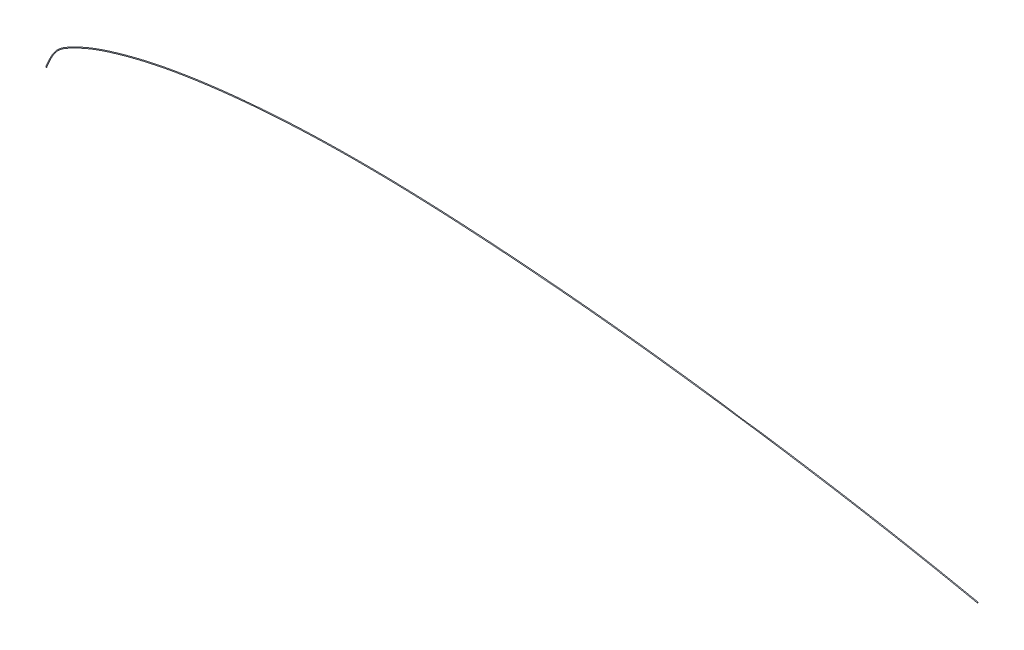
ISO-10303-21;
HEADER;
FILE_DESCRIPTION(('STEP AP214'),'2;1');
FILE_NAME('part.step','',(''),(''),'','','');
FILE_SCHEMA(('AUTOMOTIVE_DESIGN { 1 0 10303 214 1 1 1 1 }'));
ENDSEC;
DATA;
#1=APPLICATION_CONTEXT('core data for automotive mechanical design processes');
#2=APPLICATION_PROTOCOL_DEFINITION('international standard','automotive_design',2000,#1);
#3=PRODUCT_CONTEXT('',#1,'mechanical');
#4=PRODUCT('Part','Part','',(#3));
#5=PRODUCT_RELATED_PRODUCT_CATEGORY('part','',(#4));
#6=PRODUCT_DEFINITION_FORMATION('','',#4);
#7=PRODUCT_DEFINITION_CONTEXT('part definition',#1,'design');
#8=PRODUCT_DEFINITION('design','',#6,#7);
#9=PRODUCT_DEFINITION_SHAPE('','',#8);
#10=(LENGTH_UNIT() NAMED_UNIT(*) SI_UNIT(.MILLI.,.METRE.));
#11=(NAMED_UNIT(*) PLANE_ANGLE_UNIT() SI_UNIT($,.RADIAN.));
#12=(NAMED_UNIT(*) SI_UNIT($,.STERADIAN.) SOLID_ANGLE_UNIT());
#13=UNCERTAINTY_MEASURE_WITH_UNIT(LENGTH_MEASURE(1.E-05),#10,'distance_accuracy_value','');
#14=(GEOMETRIC_REPRESENTATION_CONTEXT(3) GLOBAL_UNCERTAINTY_ASSIGNED_CONTEXT((#13)) GLOBAL_UNIT_ASSIGNED_CONTEXT((#10,
#11,#12)) REPRESENTATION_CONTEXT('',''));
#15=CARTESIAN_POINT('',(0.,0.,0.));
#16=DIRECTION('',(0.,0.,1.));
#17=DIRECTION('',(1.,0.,0.));
#18=AXIS2_PLACEMENT_3D('',#15,#16,#17);
#19=CARTESIAN_POINT('',(1143.51,1.486563,0.));
#20=DIRECTION('',(0.981017726404871,0.193918076721637,0.));
#21=DIRECTION('',(0.,0.,1.));
#22=AXIS2_PLACEMENT_3D('',#19,#20,#21);
#23=PLANE('',#22);
#24=CARTESIAN_POINT('',(1143.51,1.486563,0.));
#25=DIRECTION('',(0.981017726404871,0.193918076721637,0.));
#26=DIRECTION('',(0.,0.,1.));
#27=AXIS2_PLACEMENT_3D('',#24,#25,#26);
#28=CIRCLE('',#27,0.5);
#29=CARTESIAN_POINT('',(1143.51,1.486563,0.5));
#30=VERTEX_POINT('',#29);
#31=EDGE_CURVE('E10',#30,#30,#28,.T.);
#32=ORIENTED_EDGE('',*,*,#31,.T.);
#33=EDGE_LOOP('',(#32));
#34=FACE_BOUND('',#33,.T.);
#35=ADVANCED_FACE('F37',(#34),#23,.T.);
#36=CARTESIAN_POINT('',(1143.51,1.486563,0.5));
#37=CARTESIAN_POINT('',(1124.46207060482,5.38974411269775,0.5));
#38=CARTESIAN_POINT('',(1105.4141412102,9.29292522407563,0.5));
#39=CARTESIAN_POINT('',(1029.38317967877,24.2088576357897,0.5));
#40=CARTESIAN_POINT('',(972.165379724474,34.0139840453461,0.5));
#41=CARTESIAN_POINT('',(876.754300763677,48.7648529899306,0.5));
#42=CARTESIAN_POINT('',(838.635614904716,54.2224738401747,0.5));
#43=CARTESIAN_POINT('',(762.400642536284,64.2291145867407,0.5));
#44=CARTESIAN_POINT('',(724.284739218981,68.7809880848684,0.5));
#45=CARTESIAN_POINT('',(648.043790834847,76.6614390836004,0.5));
#46=CARTESIAN_POINT('',(609.919128747438,79.9937079529373,0.5));
#47=CARTESIAN_POINT('',(533.678225680111,85.5801392898334,0.5));
#48=CARTESIAN_POINT('',(495.562165157022,87.8367519913323,0.5));
#49=CARTESIAN_POINT('',(419.304307356186,90.5487285366115,0.5));
#50=CARTESIAN_POINT('',(381.162639016645,91.0068472637165,0.5));
#51=CARTESIAN_POINT('',(304.863829096535,89.2084541382568,0.5));
#52=CARTESIAN_POINT('',(266.694921363674,86.9778200477368,0.5));
#53=CARTESIAN_POINT('',(209.48561215284,81.0164118034795,0.5));
#54=CARTESIAN_POINT('',(190.317278718343,78.5638013756268,0.5));
#55=CARTESIAN_POINT('',(152.136145317783,72.5133031307214,0.5));
#56=CARTESIAN_POINT('',(133.124023640907,68.9141766518025,0.5));
#57=CARTESIAN_POINT('',(104.679669718854,62.0435341883855,0.5));
#58=CARTESIAN_POINT('',(95.0717798047067,59.4592106570238,0.5));
#59=CARTESIAN_POINT('',(75.9498940817538,53.8284413194104,0.5));
#60=CARTESIAN_POINT('',(66.4377791275339,50.7795114415332,0.5));
#61=CARTESIAN_POINT('',(51.198012002929,44.9342966512661,0.5));
#62=CARTESIAN_POINT('',(45.3245774386292,42.4318795991824,0.5));
#63=CARTESIAN_POINT('',(36.6086483830433,38.3122228330052,0.5));
#64=CARTESIAN_POINT('',(33.7190424964081,36.8779987130043,0.5));
#65=CARTESIAN_POINT('',(27.9609287602858,33.8789725547974,0.5));
#66=CARTESIAN_POINT('',(25.0660187367064,32.3321325128898,0.5));
#67=CARTESIAN_POINT('',(19.5421071777571,28.9257430758887,0.5));
#68=CARTESIAN_POINT('',(16.9224303484844,27.0598498724912,0.5));
#69=CARTESIAN_POINT('',(12.3277842439242,22.7420671927505,0.5));
#70=CARTESIAN_POINT('',(10.3656214815009,20.2800240438444,0.5));
#71=CARTESIAN_POINT('',(5.15407876549317,12.2839240449656,0.5));
#72=CARTESIAN_POINT('',(2.57703938113762,6.14196202221847,0.5));
#73=CARTESIAN_POINT('',(0.,0.,0.5));
#74=CARTESIAN_POINT('',(1143.70391807672,0.50554527359513,0.5));
#75=CARTESIAN_POINT('',(1124.65598868155,4.40872638629077,0.5));
#76=CARTESIAN_POINT('',(1105.6108064302,8.31243855683846,0.5));
#77=CARTESIAN_POINT('',(1029.60168343433,23.2328785885634,0.5));
#78=CARTESIAN_POINT('',(972.395947717934,33.0408629657077,0.5));
#79=CARTESIAN_POINT('',(877.003005189012,47.7962448794968,0.5));
#80=CARTESIAN_POINT('',(838.891698231132,53.2557876942367,0.5));
#81=CARTESIAN_POINT('',(762.671741992761,63.2665318778937,0.5));
#82=CARTESIAN_POINT('',(724.564662838036,67.820907561146,0.5));
#83=CARTESIAN_POINT('',(648.343925696165,75.7074840380642,0.5));
#84=CARTESIAN_POINT('',(610.228737256552,79.0427977599006,0.5));
#85=CARTESIAN_POINT('',(534.005560572108,84.6351847450155,0.5));
#86=CARTESIAN_POINT('',(495.901344850365,86.8958990010136,0.5));
#87=CARTESIAN_POINT('',(419.672875701424,89.6189953315188,0.5));
#88=CARTESIAN_POINT('',(381.549505530026,90.0844063157171,0.5));
#89=CARTESIAN_POINT('',(305.294055543432,88.3054200530888,0.5));
#90=CARTESIAN_POINT('',(267.148220539226,86.085926596965,0.5));
#91=CARTESIAN_POINT('',(209.979703900395,80.1468616799469,0.5));
#92=CARTESIAN_POINT('',(190.826757783211,77.703086552974,0.5));
#93=CARTESIAN_POINT('',(152.679586568375,71.6736183505475,0.5));
#94=CARTESIAN_POINT('',(133.689775291689,68.0889277986573,0.5));
#95=CARTESIAN_POINT('',(105.286094382377,61.2482079139538,0.5));
#96=CARTESIAN_POINT('',(95.6910686792439,58.6738862975092,0.5));
#97=CARTESIAN_POINT('',(76.5938489272877,53.0632124538789,0.5));
#98=CARTESIAN_POINT('',(67.1020730483553,50.0310942553903,0.5));
#99=CARTESIAN_POINT('',(51.9070129440002,44.2286714893504,0.5));
#100=CARTESIAN_POINT('',(46.0512673837408,41.7444346065378,0.5));
#101=CARTESIAN_POINT('',(37.3610721261026,37.6534184352968,0.5));
#102=CARTESIAN_POINT('',(34.4799117555724,36.2289654333588,0.5));
#103=CARTESIAN_POINT('',(28.7382782054112,33.2497714201929,0.5));
#104=CARTESIAN_POINT('',(25.8538677874801,31.7147089317675,0.5));
#105=CARTESIAN_POINT('',(20.3809164664341,28.3795590570464,0.5));
#106=CARTESIAN_POINT('',(17.798474479872,26.5689525788122,0.5));
#107=CARTESIAN_POINT('',(13.2785838056553,22.4189361571236,0.5));
#108=CARTESIAN_POINT('',(11.3381782250594,20.0390876484918,0.5));
#109=CARTESIAN_POINT('',(6.16031267873579,12.2276997046709,0.5));
#110=CARTESIAN_POINT('',(3.57703938113762,6.1419620222157,0.5));
#111=CARTESIAN_POINT('',(1.,0.,0.5));
#112=CARTESIAN_POINT('',(1143.70391807672,0.50554527359513,-0.5));
#113=CARTESIAN_POINT('',(1124.65598868155,4.40872638629077,-0.5));
#114=CARTESIAN_POINT('',(1105.6108064302,8.31243855683846,-0.5));
#115=CARTESIAN_POINT('',(1029.60168343433,23.2328785885634,-0.5));
#116=CARTESIAN_POINT('',(972.395947717934,33.0408629657077,-0.5));
#117=CARTESIAN_POINT('',(877.003005189012,47.7962448794968,-0.5));
#118=CARTESIAN_POINT('',(838.891698231132,53.2557876942367,-0.5));
#119=CARTESIAN_POINT('',(762.671741992761,63.2665318778937,-0.5));
#120=CARTESIAN_POINT('',(724.564662838036,67.820907561146,-0.5));
#121=CARTESIAN_POINT('',(648.343925696165,75.7074840380642,-0.5));
#122=CARTESIAN_POINT('',(610.228737256552,79.0427977599006,-0.5));
#123=CARTESIAN_POINT('',(534.005560572108,84.6351847450155,-0.5));
#124=CARTESIAN_POINT('',(495.901344850365,86.8958990010136,-0.5));
#125=CARTESIAN_POINT('',(419.672875701424,89.6189953315188,-0.5));
#126=CARTESIAN_POINT('',(381.549505530026,90.0844063157171,-0.5));
#127=CARTESIAN_POINT('',(305.294055543432,88.3054200530888,-0.5));
#128=CARTESIAN_POINT('',(267.148220539226,86.085926596965,-0.5));
#129=CARTESIAN_POINT('',(209.979703900395,80.1468616799469,-0.5));
#130=CARTESIAN_POINT('',(190.826757783211,77.703086552974,-0.5));
#131=CARTESIAN_POINT('',(152.679586568375,71.6736183505475,-0.5));
#132=CARTESIAN_POINT('',(133.689775291689,68.0889277986573,-0.5));
#133=CARTESIAN_POINT('',(105.286094382377,61.2482079139538,-0.5));
#134=CARTESIAN_POINT('',(95.6910686792439,58.6738862975092,-0.5));
#135=CARTESIAN_POINT('',(76.5938489272877,53.0632124538789,-0.5));
#136=CARTESIAN_POINT('',(67.1020730483553,50.0310942553903,-0.5));
#137=CARTESIAN_POINT('',(51.9070129440002,44.2286714893504,-0.5));
#138=CARTESIAN_POINT('',(46.0512673837408,41.7444346065378,-0.5));
#139=CARTESIAN_POINT('',(37.3610721261026,37.6534184352968,-0.5));
#140=CARTESIAN_POINT('',(34.4799117555724,36.2289654333588,-0.5));
#141=CARTESIAN_POINT('',(28.7382782054112,33.2497714201929,-0.5));
#142=CARTESIAN_POINT('',(25.8538677874801,31.7147089317675,-0.5));
#143=CARTESIAN_POINT('',(20.3809164664341,28.3795590570464,-0.5));
#144=CARTESIAN_POINT('',(17.798474479872,26.5689525788122,-0.5));
#145=CARTESIAN_POINT('',(13.2785838056553,22.4189361571236,-0.5));
#146=CARTESIAN_POINT('',(11.3381782250594,20.0390876484918,-0.5));
#147=CARTESIAN_POINT('',(6.16031267873579,12.2276997046709,-0.5));
#148=CARTESIAN_POINT('',(3.57703938113762,6.1419620222157,-0.5));
#149=CARTESIAN_POINT('',(1.,0.,-0.5));
#150=CARTESIAN_POINT('',(1143.51,1.486563,-0.5));
#151=CARTESIAN_POINT('',(1124.46207060482,5.38974411269775,-0.5));
#152=CARTESIAN_POINT('',(1105.4141412102,9.29292522407563,-0.5));
#153=CARTESIAN_POINT('',(1029.38317967877,24.2088576357897,-0.5));
#154=CARTESIAN_POINT('',(972.165379724474,34.0139840453461,-0.5));
#155=CARTESIAN_POINT('',(876.754300763677,48.7648529899306,-0.5));
#156=CARTESIAN_POINT('',(838.635614904716,54.2224738401747,-0.5));
#157=CARTESIAN_POINT('',(762.400642536284,64.2291145867407,-0.5));
#158=CARTESIAN_POINT('',(724.284739218981,68.7809880848684,-0.5));
#159=CARTESIAN_POINT('',(648.043790834847,76.6614390836004,-0.5));
#160=CARTESIAN_POINT('',(609.919128747438,79.9937079529373,-0.5));
#161=CARTESIAN_POINT('',(533.678225680111,85.5801392898334,-0.5));
#162=CARTESIAN_POINT('',(495.562165157022,87.8367519913323,-0.5));
#163=CARTESIAN_POINT('',(419.304307356186,90.5487285366115,-0.5));
#164=CARTESIAN_POINT('',(381.162639016645,91.0068472637165,-0.5));
#165=CARTESIAN_POINT('',(304.863829096535,89.2084541382568,-0.5));
#166=CARTESIAN_POINT('',(266.694921363674,86.9778200477368,-0.5));
#167=CARTESIAN_POINT('',(209.48561215284,81.0164118034795,-0.5));
#168=CARTESIAN_POINT('',(190.317278718343,78.5638013756268,-0.5));
#169=CARTESIAN_POINT('',(152.136145317783,72.5133031307214,-0.5));
#170=CARTESIAN_POINT('',(133.124023640907,68.9141766518025,-0.5));
#171=CARTESIAN_POINT('',(104.679669718854,62.0435341883855,-0.5));
#172=CARTESIAN_POINT('',(95.0717798047067,59.4592106570238,-0.5));
#173=CARTESIAN_POINT('',(75.9498940817538,53.8284413194104,-0.5));
#174=CARTESIAN_POINT('',(66.4377791275339,50.7795114415332,-0.5));
#175=CARTESIAN_POINT('',(51.198012002929,44.9342966512661,-0.5));
#176=CARTESIAN_POINT('',(45.3245774386292,42.4318795991824,-0.5));
#177=CARTESIAN_POINT('',(36.6086483830433,38.3122228330052,-0.5));
#178=CARTESIAN_POINT('',(33.7190424964081,36.8779987130043,-0.5));
#179=CARTESIAN_POINT('',(27.9609287602858,33.8789725547974,-0.5));
#180=CARTESIAN_POINT('',(25.0660187367064,32.3321325128898,-0.5));
#181=CARTESIAN_POINT('',(19.5421071777571,28.9257430758887,-0.5));
#182=CARTESIAN_POINT('',(16.9224303484844,27.0598498724912,-0.5));
#183=CARTESIAN_POINT('',(12.3277842439242,22.7420671927505,-0.5));
#184=CARTESIAN_POINT('',(10.3656214815009,20.2800240438444,-0.5));
#185=CARTESIAN_POINT('',(5.15407876549317,12.2839240449656,-0.5));
#186=CARTESIAN_POINT('',(2.57703938113762,6.14196202221847,-0.5));
#187=CARTESIAN_POINT('',(0.,0.,-0.5));
#188=CARTESIAN_POINT('',(1143.31608192328,2.46758072640487,-0.5));
#189=CARTESIAN_POINT('',(1124.2681525281,6.37076183910473,-0.5));
#190=CARTESIAN_POINT('',(1105.21747599019,10.2734118913128,-0.5));
#191=CARTESIAN_POINT('',(1029.1646759232,25.1848366830161,-0.5));
#192=CARTESIAN_POINT('',(971.934811731013,34.9871051249845,-0.5));
#193=CARTESIAN_POINT('',(876.505596338342,49.7334611003644,-0.5));
#194=CARTESIAN_POINT('',(838.379531578301,55.1891599861127,-0.5));
#195=CARTESIAN_POINT('',(762.129543079807,65.1916972955877,-0.5));
#196=CARTESIAN_POINT('',(724.004815599926,69.7410686085908,-0.5));
#197=CARTESIAN_POINT('',(647.74365597353,77.6153941291365,-0.5));
#198=CARTESIAN_POINT('',(609.609520238324,80.944618145974,-0.5));
#199=CARTESIAN_POINT('',(533.350890788115,86.5250938346514,-0.5));
#200=CARTESIAN_POINT('',(495.222985463679,88.777604981651,-0.5));
#201=CARTESIAN_POINT('',(418.935739010949,91.4784617417042,-0.5));
#202=CARTESIAN_POINT('',(380.775772503264,91.929288211716,-0.5));
#203=CARTESIAN_POINT('',(304.433602649638,90.1114882234248,-0.5));
#204=CARTESIAN_POINT('',(266.241622188122,87.8697134985086,-0.5));
#205=CARTESIAN_POINT('',(208.991520405284,81.885961927012,-0.5));
#206=CARTESIAN_POINT('',(189.807799653475,79.4245161982797,-0.5));
#207=CARTESIAN_POINT('',(151.592704067192,73.3529879108952,-0.5));
#208=CARTESIAN_POINT('',(132.558271990125,69.7394255049477,-0.5));
#209=CARTESIAN_POINT('',(104.073245055332,62.8388604628172,-0.5));
#210=CARTESIAN_POINT('',(94.4524909301695,60.2445350165384,-0.5));
#211=CARTESIAN_POINT('',(75.3059392362198,54.5936701849418,-0.5));
#212=CARTESIAN_POINT('',(65.7734852067126,51.527928627676,-0.5));
#213=CARTESIAN_POINT('',(50.4890110618579,45.6399218131818,-0.5));
#214=CARTESIAN_POINT('',(44.5978874935177,43.1193245918269,-0.5));
#215=CARTESIAN_POINT('',(35.856224639984,38.9710272307136,-0.5));
#216=CARTESIAN_POINT('',(32.9581732372439,37.5270319926498,-0.5));
#217=CARTESIAN_POINT('',(27.1835793151603,34.508173689402,-0.5));
#218=CARTESIAN_POINT('',(24.2781696859326,32.9495560940121,-0.5));
#219=CARTESIAN_POINT('',(18.7032978890801,29.471927094731,-0.5));
#220=CARTESIAN_POINT('',(16.0463862170967,27.5507471661702,-0.5));
#221=CARTESIAN_POINT('',(11.3769846821931,23.0651982283773,-0.5));
#222=CARTESIAN_POINT('',(9.39306473794243,20.5209604391971,-0.5));
#223=CARTESIAN_POINT('',(4.14784485225054,12.3401483852604,-0.5));
#224=CARTESIAN_POINT('',(1.57703938113762,6.14196202222125,-0.5));
#225=CARTESIAN_POINT('',(-1.,0.,-0.5));
#226=CARTESIAN_POINT('',(1143.31608192328,2.46758072640487,0.5));
#227=CARTESIAN_POINT('',(1124.2681525281,6.37076183910473,0.5));
#228=CARTESIAN_POINT('',(1105.21747599019,10.2734118913128,0.5));
#229=CARTESIAN_POINT('',(1029.1646759232,25.1848366830161,0.5));
#230=CARTESIAN_POINT('',(971.934811731013,34.9871051249845,0.5));
#231=CARTESIAN_POINT('',(876.505596338342,49.7334611003644,0.5));
#232=CARTESIAN_POINT('',(838.379531578301,55.1891599861127,0.5));
#233=CARTESIAN_POINT('',(762.129543079807,65.1916972955877,0.5));
#234=CARTESIAN_POINT('',(724.004815599926,69.7410686085908,0.5));
#235=CARTESIAN_POINT('',(647.74365597353,77.6153941291365,0.5));
#236=CARTESIAN_POINT('',(609.609520238324,80.944618145974,0.5));
#237=CARTESIAN_POINT('',(533.350890788115,86.5250938346514,0.5));
#238=CARTESIAN_POINT('',(495.222985463679,88.777604981651,0.5));
#239=CARTESIAN_POINT('',(418.935739010949,91.4784617417042,0.5));
#240=CARTESIAN_POINT('',(380.775772503264,91.929288211716,0.5));
#241=CARTESIAN_POINT('',(304.433602649638,90.1114882234248,0.5));
#242=CARTESIAN_POINT('',(266.241622188122,87.8697134985086,0.5));
#243=CARTESIAN_POINT('',(208.991520405284,81.885961927012,0.5));
#244=CARTESIAN_POINT('',(189.807799653475,79.4245161982797,0.5));
#245=CARTESIAN_POINT('',(151.592704067192,73.3529879108952,0.5));
#246=CARTESIAN_POINT('',(132.558271990125,69.7394255049477,0.5));
#247=CARTESIAN_POINT('',(104.073245055332,62.8388604628172,0.5));
#248=CARTESIAN_POINT('',(94.4524909301695,60.2445350165384,0.5));
#249=CARTESIAN_POINT('',(75.3059392362198,54.5936701849418,0.5));
#250=CARTESIAN_POINT('',(65.7734852067126,51.527928627676,0.5));
#251=CARTESIAN_POINT('',(50.4890110618579,45.6399218131818,0.5));
#252=CARTESIAN_POINT('',(44.5978874935177,43.1193245918269,0.5));
#253=CARTESIAN_POINT('',(35.856224639984,38.9710272307136,0.5));
#254=CARTESIAN_POINT('',(32.9581732372439,37.5270319926498,0.5));
#255=CARTESIAN_POINT('',(27.1835793151603,34.508173689402,0.5));
#256=CARTESIAN_POINT('',(24.2781696859326,32.9495560940121,0.5));
#257=CARTESIAN_POINT('',(18.7032978890801,29.471927094731,0.5));
#258=CARTESIAN_POINT('',(16.0463862170967,27.5507471661702,0.5));
#259=CARTESIAN_POINT('',(11.3769846821931,23.0651982283773,0.5));
#260=CARTESIAN_POINT('',(9.39306473794243,20.5209604391971,0.5));
#261=CARTESIAN_POINT('',(4.14784485225054,12.3401483852604,0.5));
#262=CARTESIAN_POINT('',(1.57703938113762,6.14196202222125,0.5));
#263=CARTESIAN_POINT('',(-1.,0.,0.5));
#264=CARTESIAN_POINT('',(1143.51,1.486563,0.5));
#265=CARTESIAN_POINT('',(1124.46207060482,5.38974411269775,0.5));
#266=CARTESIAN_POINT('',(1105.4141412102,9.29292522407563,0.5));
#267=CARTESIAN_POINT('',(1029.38317967877,24.2088576357897,0.5));
#268=CARTESIAN_POINT('',(972.165379724474,34.0139840453461,0.5));
#269=CARTESIAN_POINT('',(876.754300763677,48.7648529899306,0.5));
#270=CARTESIAN_POINT('',(838.635614904716,54.2224738401747,0.5));
#271=CARTESIAN_POINT('',(762.400642536284,64.2291145867407,0.5));
#272=CARTESIAN_POINT('',(724.284739218981,68.7809880848684,0.5));
#273=CARTESIAN_POINT('',(648.043790834847,76.6614390836004,0.5));
#274=CARTESIAN_POINT('',(609.919128747438,79.9937079529373,0.5));
#275=CARTESIAN_POINT('',(533.678225680111,85.5801392898334,0.5));
#276=CARTESIAN_POINT('',(495.562165157022,87.8367519913323,0.5));
#277=CARTESIAN_POINT('',(419.304307356186,90.5487285366115,0.5));
#278=CARTESIAN_POINT('',(381.162639016645,91.0068472637165,0.5));
#279=CARTESIAN_POINT('',(304.863829096535,89.2084541382568,0.5));
#280=CARTESIAN_POINT('',(266.694921363674,86.9778200477368,0.5));
#281=CARTESIAN_POINT('',(209.48561215284,81.0164118034795,0.5));
#282=CARTESIAN_POINT('',(190.317278718343,78.5638013756268,0.5));
#283=CARTESIAN_POINT('',(152.136145317783,72.5133031307214,0.5));
#284=CARTESIAN_POINT('',(133.124023640907,68.9141766518025,0.5));
#285=CARTESIAN_POINT('',(104.679669718854,62.0435341883855,0.5));
#286=CARTESIAN_POINT('',(95.0717798047067,59.4592106570238,0.5));
#287=CARTESIAN_POINT('',(75.9498940817538,53.8284413194104,0.5));
#288=CARTESIAN_POINT('',(66.4377791275339,50.7795114415332,0.5));
#289=CARTESIAN_POINT('',(51.198012002929,44.9342966512661,0.5));
#290=CARTESIAN_POINT('',(45.3245774386292,42.4318795991824,0.5));
#291=CARTESIAN_POINT('',(36.6086483830433,38.3122228330052,0.5));
#292=CARTESIAN_POINT('',(33.7190424964081,36.8779987130043,0.5));
#293=CARTESIAN_POINT('',(27.9609287602858,33.8789725547974,0.5));
#294=CARTESIAN_POINT('',(25.0660187367064,32.3321325128898,0.5));
#295=CARTESIAN_POINT('',(19.5421071777571,28.9257430758887,0.5));
#296=CARTESIAN_POINT('',(16.9224303484844,27.0598498724912,0.5));
#297=CARTESIAN_POINT('',(12.3277842439242,22.7420671927505,0.5));
#298=CARTESIAN_POINT('',(10.3656214815009,20.2800240438444,0.5));
#299=CARTESIAN_POINT('',(5.15407876549317,12.2839240449656,0.5));
#300=CARTESIAN_POINT('',(2.57703938113762,6.14196202221847,0.5));
#301=CARTESIAN_POINT('',(0.,0.,0.5));
#302=(BOUNDED_SURFACE() B_SPLINE_SURFACE(3,3,((#36,#37,#38,#39,#40,#41,#42,#43,#44,#45,#46,#47,
#48,#49,#50,#51,#52,#53,#54,#55,#56,#57,#58,#59,#60,#61,#62,#63,#64,#65,#66,#67,#68,#69,#70,#71,
#72,#73),(#74,#75,#76,#77,#78,#79,#80,#81,#82,#83,#84,#85,#86,#87,#88,#89,#90,#91,#92,#93,#94,
#95,#96,#97,#98,#99,#100,#101,#102,#103,#104,#105,#106,#107,#108,#109,#110,#111),(#112,#113,
#114,#115,#116,#117,#118,#119,#120,#121,#122,#123,#124,#125,#126,#127,#128,#129,#130,#131,#132,
#133,#134,#135,#136,#137,#138,#139,#140,#141,#142,#143,#144,#145,#146,#147,#148,#149),(#150,
#151,#152,#153,#154,#155,#156,#157,#158,#159,#160,#161,#162,#163,#164,#165,#166,#167,#168,#169,
#170,#171,#172,#173,#174,#175,#176,#177,#178,#179,#180,#181,#182,#183,#184,#185,#186,#187),
(#188,#189,#190,#191,#192,#193,#194,#195,#196,#197,#198,#199,#200,#201,#202,#203,#204,#205,#206,
#207,#208,#209,#210,#211,#212,#213,#214,#215,#216,#217,#218,#219,#220,#221,#222,#223,#224,#225),
(#226,#227,#228,#229,#230,#231,#232,#233,#234,#235,#236,#237,#238,#239,#240,#241,#242,#243,#244,
#245,#246,#247,#248,#249,#250,#251,#252,#253,#254,#255,#256,#257,#258,#259,#260,#261,#262,#263),
(#264,#265,#266,#267,#268,#269,#270,#271,#272,#273,#274,#275,#276,#277,#278,#279,#280,#281,#282,
#283,#284,#285,#286,#287,#288,#289,#290,#291,#292,#293,#294,#295,#296,#297,#298,#299,#300,
#301)),.UNSPECIFIED.,.T.,.F.,.F.) B_SPLINE_SURFACE_WITH_KNOTS((4,3,4),(4,2,2,2,2,2,2,2,2,2,2,2,
2,2,2,2,2,2,4),(0.,0.5,1.),(0.,0.0496812988513004,0.197976307844625,0.296362491062684,
0.394433617199178,0.492205408317245,0.589753408165241,0.687151928165711,0.784753711389578,
0.834119584128113,0.883485456866648,0.908917356863356,0.934349256860064,0.950761942645048,
0.95896828553754,0.967174628430032,0.975380971322524,0.983587314215016,1.),
.UNSPECIFIED.) GEOMETRIC_REPRESENTATION_ITEM() RATIONAL_B_SPLINE_SURFACE(((1.,1.,1.,1.,1.,1.,1.,
1.,1.,1.,1.,1.,1.,1.,1.,1.,1.,1.,1.,1.,1.,1.,1.,1.,1.,1.,1.,1.,1.,1.,1.,1.,1.,1.,1.,1.,1.,1.),
(0.333333333333333,0.333333333333333,0.333333333333333,0.333333333333333,0.333333333333333,
0.333333333333333,0.333333333333333,0.333333333333333,0.333333333333333,0.333333333333333,
0.333333333333333,0.333333333333333,0.333333333333333,0.333333333333333,0.333333333333333,
0.333333333333333,0.333333333333333,0.333333333333333,0.333333333333333,0.333333333333333,
0.333333333333333,0.333333333333333,0.333333333333333,0.333333333333333,0.333333333333333,
0.333333333333333,0.333333333333333,0.333333333333333,0.333333333333333,0.333333333333333,
0.333333333333333,0.333333333333333,0.333333333333333,0.333333333333333,0.333333333333333,
0.333333333333333,0.333333333333333,0.333333333333333),(0.333333333333333,0.333333333333333,
0.333333333333333,0.333333333333333,0.333333333333333,0.333333333333333,0.333333333333333,
0.333333333333333,0.333333333333333,0.333333333333333,0.333333333333333,0.333333333333333,
0.333333333333333,0.333333333333333,0.333333333333333,0.333333333333333,0.333333333333333,
0.333333333333333,0.333333333333333,0.333333333333333,0.333333333333333,0.333333333333333,
0.333333333333333,0.333333333333333,0.333333333333333,0.333333333333333,0.333333333333333,
0.333333333333333,0.333333333333333,0.333333333333333,0.333333333333333,0.333333333333333,
0.333333333333333,0.333333333333333,0.333333333333333,0.333333333333333,0.333333333333333,
0.333333333333333),(1.,1.,1.,1.,1.,1.,1.,1.,1.,1.,1.,1.,1.,1.,1.,1.,1.,1.,1.,1.,1.,1.,1.,1.,1.,
1.,1.,1.,1.,1.,1.,1.,1.,1.,1.,1.,1.,1.),(0.333333333333333,0.333333333333333,0.333333333333333,
0.333333333333333,0.333333333333333,0.333333333333333,0.333333333333333,0.333333333333333,
0.333333333333333,0.333333333333333,0.333333333333333,0.333333333333333,0.333333333333333,
0.333333333333333,0.333333333333333,0.333333333333333,0.333333333333333,0.333333333333333,
0.333333333333333,0.333333333333333,0.333333333333333,0.333333333333333,0.333333333333333,
0.333333333333333,0.333333333333333,0.333333333333333,0.333333333333333,0.333333333333333,
0.333333333333333,0.333333333333333,0.333333333333333,0.333333333333333,0.333333333333333,
0.333333333333333,0.333333333333333,0.333333333333333,0.333333333333333,0.333333333333333),
(0.333333333333333,0.333333333333333,0.333333333333333,0.333333333333333,0.333333333333333,
0.333333333333333,0.333333333333333,0.333333333333333,0.333333333333333,0.333333333333333,
0.333333333333333,0.333333333333333,0.333333333333333,0.333333333333333,0.333333333333333,
0.333333333333333,0.333333333333333,0.333333333333333,0.333333333333333,0.333333333333333,
0.333333333333333,0.333333333333333,0.333333333333333,0.333333333333333,0.333333333333333,
0.333333333333333,0.333333333333333,0.333333333333333,0.333333333333333,0.333333333333333,
0.333333333333333,0.333333333333333,0.333333333333333,0.333333333333333,0.333333333333333,
0.333333333333333,0.333333333333333,0.333333333333333),(1.,1.,1.,1.,1.,1.,1.,1.,1.,1.,1.,1.,1.,
1.,1.,1.,1.,1.,1.,1.,1.,1.,1.,1.,1.,1.,1.,1.,1.,1.,1.,1.,1.,1.,1.,1.,1.,1.))) REPRESENTATION_ITEM('') SURFACE());
#303=CARTESIAN_POINT('',(0.,0.,0.));
#304=DIRECTION('',(0.,1.,0.));
#305=DIRECTION('',(0.,0.,1.));
#306=AXIS2_PLACEMENT_3D('',#303,#304,#305);
#307=CIRCLE('',#306,0.5);
#308=CARTESIAN_POINT('',(0.,0.,0.5));
#309=VERTEX_POINT('',#308);
#310=EDGE_CURVE('E47',#309,#309,#307,.T.);
#311=ORIENTED_EDGE('',*,*,#310,.T.);
#312=EDGE_LOOP('',(#311));
#313=FACE_BOUND('',#312,.T.);
#314=ORIENTED_EDGE('',*,*,#31,.F.);
#315=EDGE_LOOP('',(#314));
#316=FACE_BOUND('',#315,.T.);
#317=ADVANCED_FACE('F54',(#313,#316),#302,.F.);
#318=CARTESIAN_POINT('',(0.,-1.,0.));
#319=DIRECTION('',(0.,1.,0.));
#320=DIRECTION('',(0.,0.,1.));
#321=AXIS2_PLACEMENT_3D('',#318,#319,#320);
#322=CYLINDRICAL_SURFACE('',#321,0.5);
#323=CARTESIAN_POINT('',(0.,-1.,0.));
#324=DIRECTION('',(0.,1.,0.));
#325=DIRECTION('',(0.,0.,1.));
#326=AXIS2_PLACEMENT_3D('',#323,#324,#325);
#327=CIRCLE('',#326,0.5);
#328=CARTESIAN_POINT('',(0.,-1.,0.5));
#329=VERTEX_POINT('',#328);
#330=EDGE_CURVE('E43',#329,#329,#327,.T.);
#331=ORIENTED_EDGE('',*,*,#330,.T.);
#332=EDGE_LOOP('',(#331));
#333=FACE_BOUND('',#332,.T.);
#334=ORIENTED_EDGE('',*,*,#310,.F.);
#335=EDGE_LOOP('',(#334));
#336=FACE_BOUND('',#335,.T.);
#337=ADVANCED_FACE('F57',(#333,#336),#322,.T.);
#338=CARTESIAN_POINT('',(0.,-1.,0.));
#339=DIRECTION('',(0.,1.,0.));
#340=DIRECTION('',(0.,0.,1.));
#341=AXIS2_PLACEMENT_3D('',#338,#339,#340);
#342=PLANE('',#341);
#343=ORIENTED_EDGE('',*,*,#330,.F.);
#344=EDGE_LOOP('',(#343));
#345=FACE_BOUND('',#344,.T.);
#346=ADVANCED_FACE('F59',(#345),#342,.F.);
#347=CLOSED_SHELL('',(#35,#317,#337,#346));
#348=MANIFOLD_SOLID_BREP('B2',#347);
#349=ADVANCED_BREP_SHAPE_REPRESENTATION('',(#18,#348),#14);
#350=SHAPE_DEFINITION_REPRESENTATION(#9,#349);
ENDSEC;
END-ISO-10303-21;
